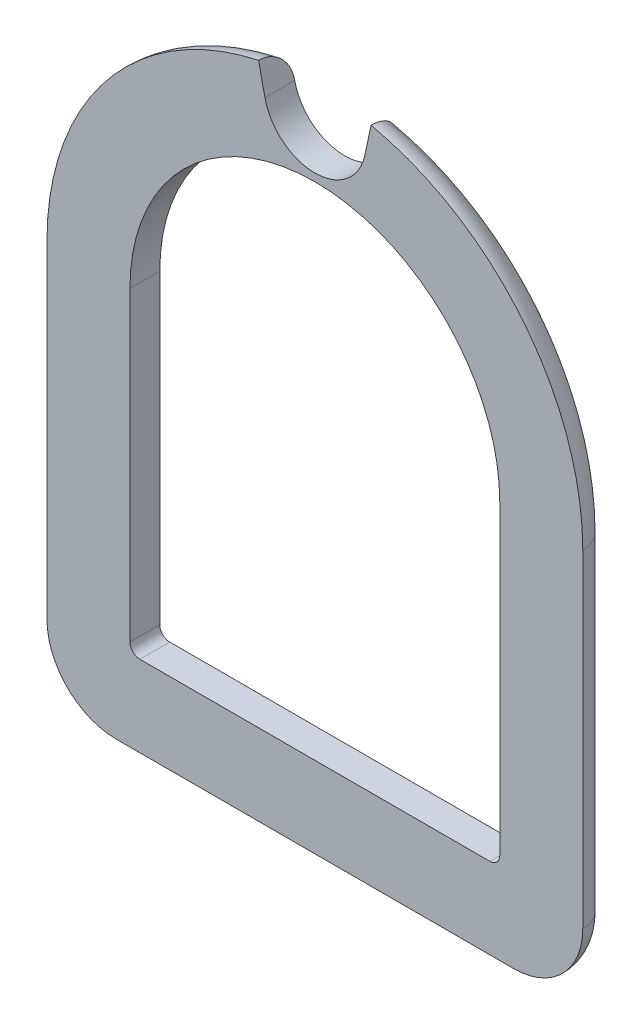
ISO-10303-21;
HEADER;
FILE_DESCRIPTION(('STEP AP214'),'2;1');
FILE_NAME('part.step','',(''),(''),'','','');
FILE_SCHEMA(('AUTOMOTIVE_DESIGN { 1 0 10303 214 1 1 1 1 }'));
ENDSEC;
DATA;
#1=APPLICATION_CONTEXT('core data for automotive mechanical design processes');
#2=APPLICATION_PROTOCOL_DEFINITION('international standard','automotive_design',2000,#1);
#3=PRODUCT_CONTEXT('',#1,'mechanical');
#4=PRODUCT('Part','Part','',(#3));
#5=PRODUCT_RELATED_PRODUCT_CATEGORY('part','',(#4));
#6=PRODUCT_DEFINITION_FORMATION('','',#4);
#7=PRODUCT_DEFINITION_CONTEXT('part definition',#1,'design');
#8=PRODUCT_DEFINITION('design','',#6,#7);
#9=PRODUCT_DEFINITION_SHAPE('','',#8);
#10=(LENGTH_UNIT() NAMED_UNIT(*) SI_UNIT(.MILLI.,.METRE.));
#11=(NAMED_UNIT(*) PLANE_ANGLE_UNIT() SI_UNIT($,.RADIAN.));
#12=(NAMED_UNIT(*) SI_UNIT($,.STERADIAN.) SOLID_ANGLE_UNIT());
#13=UNCERTAINTY_MEASURE_WITH_UNIT(LENGTH_MEASURE(1.E-05),#10,'distance_accuracy_value','');
#14=(GEOMETRIC_REPRESENTATION_CONTEXT(3) GLOBAL_UNCERTAINTY_ASSIGNED_CONTEXT((#13)) GLOBAL_UNIT_ASSIGNED_CONTEXT((#10,
#11,#12)) REPRESENTATION_CONTEXT('',''));
#15=CARTESIAN_POINT('',(0.,0.,0.));
#16=DIRECTION('',(0.,0.,1.));
#17=DIRECTION('',(1.,0.,0.));
#18=AXIS2_PLACEMENT_3D('',#15,#16,#17);
#19=CARTESIAN_POINT('',(0.,0.,56.8469714478884));
#20=DIRECTION('',(0.,0.,-1.));
#21=DIRECTION('',(-1.,0.,0.));
#22=AXIS2_PLACEMENT_3D('',#19,#20,#21);
#23=CYLINDRICAL_SURFACE('',#22,9.3);
#24=DIRECTION('',(0.,0.,-1.));
#25=VECTOR('',#24,1.);
#26=CARTESIAN_POINT('',(9.3,0.,56.8469714478884));
#27=LINE('',#26,#25);
#28=CARTESIAN_POINT('',(9.3,0.,1.5));
#29=VERTEX_POINT('',#28);
#30=CARTESIAN_POINT('',(9.3,0.,0.));
#31=VERTEX_POINT('',#30);
#32=EDGE_CURVE('E234',#29,#31,#27,.T.);
#33=ORIENTED_EDGE('',*,*,#32,.F.);
#34=CARTESIAN_POINT('',(0.,0.,1.5));
#35=DIRECTION('',(0.,0.,1.));
#36=DIRECTION('',(1.,0.,0.));
#37=AXIS2_PLACEMENT_3D('',#34,#35,#36);
#38=CIRCLE('',#37,9.3);
#39=CARTESIAN_POINT('',(-9.3,0.,1.5));
#40=VERTEX_POINT('',#39);
#41=EDGE_CURVE('E426',#29,#40,#38,.T.);
#42=ORIENTED_EDGE('',*,*,#41,.T.);
#43=DIRECTION('',(0.,0.,-1.));
#44=VECTOR('',#43,1.);
#45=CARTESIAN_POINT('',(-9.3,0.,56.8469714478884));
#46=LINE('',#45,#44);
#47=CARTESIAN_POINT('',(-9.3,0.,0.));
#48=VERTEX_POINT('',#47);
#49=EDGE_CURVE('E76',#40,#48,#46,.T.);
#50=ORIENTED_EDGE('',*,*,#49,.T.);
#51=CARTESIAN_POINT('',(0.,0.,0.));
#52=DIRECTION('',(0.,0.,1.));
#53=DIRECTION('',(1.,0.,0.));
#54=AXIS2_PLACEMENT_3D('',#51,#52,#53);
#55=CIRCLE('',#54,9.3);
#56=EDGE_CURVE('E60',#31,#48,#55,.T.);
#57=ORIENTED_EDGE('',*,*,#56,.F.);
#58=EDGE_LOOP('',(#33,#42,#50,#57));
#59=FACE_BOUND('',#58,.T.);
#60=ADVANCED_FACE('F48',(#59),#23,.F.);
#61=CARTESIAN_POINT('',(-9.3,-15.9,56.8469714478884));
#62=DIRECTION('',(1.,0.,0.));
#63=DIRECTION('',(0.,0.,-1.));
#64=AXIS2_PLACEMENT_3D('',#61,#62,#63);
#65=PLANE('',#64);
#66=ORIENTED_EDGE('',*,*,#49,.F.);
#67=DIRECTION('',(0.,-1.,0.));
#68=VECTOR('',#67,1.);
#69=CARTESIAN_POINT('',(-9.3,-15.9,1.5));
#70=LINE('',#69,#68);
#71=CARTESIAN_POINT('',(-9.3,-15.4,1.5));
#72=VERTEX_POINT('',#71);
#73=EDGE_CURVE('E432',#40,#72,#70,.T.);
#74=ORIENTED_EDGE('',*,*,#73,.T.);
#75=DIRECTION('',(0.,0.,-1.));
#76=VECTOR('',#75,1.);
#77=CARTESIAN_POINT('',(-9.3,-15.4,0.));
#78=LINE('',#77,#76);
#79=CARTESIAN_POINT('',(-9.3,-15.4,0.));
#80=VERTEX_POINT('',#79);
#81=EDGE_CURVE('E245',#72,#80,#78,.T.);
#82=ORIENTED_EDGE('',*,*,#81,.T.);
#83=DIRECTION('',(0.,-1.,0.));
#84=VECTOR('',#83,1.);
#85=CARTESIAN_POINT('',(-9.3,-15.9,0.));
#86=LINE('',#85,#84);
#87=EDGE_CURVE('E238',#48,#80,#86,.T.);
#88=ORIENTED_EDGE('',*,*,#87,.F.);
#89=EDGE_LOOP('',(#66,#74,#82,#88));
#90=FACE_BOUND('',#89,.T.);
#91=ADVANCED_FACE('F457',(#90),#65,.T.);
#92=CARTESIAN_POINT('',(0.,-15.9,56.8469714478884));
#93=DIRECTION('',(0.,1.,0.));
#94=DIRECTION('',(0.,0.,1.));
#95=AXIS2_PLACEMENT_3D('',#92,#93,#94);
#96=PLANE('',#95);
#97=DIRECTION('',(0.,0.,-1.));
#98=VECTOR('',#97,1.);
#99=CARTESIAN_POINT('',(-8.8,-15.9,6.02159565602451));
#100=LINE('',#99,#98);
#101=CARTESIAN_POINT('',(-8.8,-15.9,0.));
#102=VERTEX_POINT('',#101);
#103=CARTESIAN_POINT('',(-8.8,-15.9,1.5));
#104=VERTEX_POINT('',#103);
#105=EDGE_CURVE('E256',#102,#104,#100,.F.);
#106=ORIENTED_EDGE('',*,*,#105,.T.);
#107=DIRECTION('',(1.,0.,0.));
#108=VECTOR('',#107,1.);
#109=CARTESIAN_POINT('',(0.,-15.9,1.5));
#110=LINE('',#109,#108);
#111=CARTESIAN_POINT('',(8.8,-15.9,1.5));
#112=VERTEX_POINT('',#111);
#113=EDGE_CURVE('E422',#104,#112,#110,.T.);
#114=ORIENTED_EDGE('',*,*,#113,.T.);
#115=DIRECTION('',(0.,0.,-1.));
#116=VECTOR('',#115,1.);
#117=CARTESIAN_POINT('',(8.8,-15.9,0.));
#118=LINE('',#117,#116);
#119=CARTESIAN_POINT('',(8.8,-15.9,0.));
#120=VERTEX_POINT('',#119);
#121=EDGE_CURVE('E253',#112,#120,#118,.T.);
#122=ORIENTED_EDGE('',*,*,#121,.T.);
#123=DIRECTION('',(1.,0.,0.));
#124=VECTOR('',#123,1.);
#125=CARTESIAN_POINT('',(0.,-15.9,0.));
#126=LINE('',#125,#124);
#127=EDGE_CURVE('E233',#102,#120,#126,.T.);
#128=ORIENTED_EDGE('',*,*,#127,.F.);
#129=EDGE_LOOP('',(#106,#114,#122,#128));
#130=FACE_BOUND('',#129,.T.);
#131=ADVANCED_FACE('F451',(#130),#96,.T.);
#132=CARTESIAN_POINT('',(-8.8,-15.4,56.8469714478884));
#133=DIRECTION('',(0.,0.,1.));
#134=DIRECTION('',(1.,0.,0.));
#135=AXIS2_PLACEMENT_3D('',#132,#133,#134);
#136=CYLINDRICAL_SURFACE('',#135,0.5);
#137=CARTESIAN_POINT('',(-8.8,-15.4,1.5));
#138=DIRECTION('',(0.,0.,1.));
#139=DIRECTION('',(1.,0.,0.));
#140=AXIS2_PLACEMENT_3D('',#137,#138,#139);
#141=CIRCLE('',#140,0.5);
#142=EDGE_CURVE('E429',#104,#72,#141,.F.);
#143=ORIENTED_EDGE('',*,*,#142,.F.);
#144=ORIENTED_EDGE('',*,*,#105,.F.);
#145=CARTESIAN_POINT('',(-8.8,-15.4,0.));
#146=DIRECTION('',(0.,0.,1.));
#147=DIRECTION('',(1.,0.,0.));
#148=AXIS2_PLACEMENT_3D('',#145,#146,#147);
#149=CIRCLE('',#148,0.5);
#150=EDGE_CURVE('E435',#80,#102,#149,.T.);
#151=ORIENTED_EDGE('',*,*,#150,.F.);
#152=ORIENTED_EDGE('',*,*,#81,.F.);
#153=EDGE_LOOP('',(#143,#144,#151,#152));
#154=FACE_BOUND('',#153,.T.);
#155=ADVANCED_FACE('F454',(#154),#136,.F.);
#156=CARTESIAN_POINT('',(9.3,0.,56.8469714478884));
#157=DIRECTION('',(-1.,0.,0.));
#158=DIRECTION('',(0.,-1.,0.));
#159=AXIS2_PLACEMENT_3D('',#156,#157,#158);
#160=PLANE('',#159);
#161=DIRECTION('',(0.,0.,-1.));
#162=VECTOR('',#161,1.);
#163=CARTESIAN_POINT('',(9.3,-15.4,6.0215956560245));
#164=LINE('',#163,#162);
#165=CARTESIAN_POINT('',(9.3,-15.4,0.));
#166=VERTEX_POINT('',#165);
#167=CARTESIAN_POINT('',(9.3,-15.4,1.5));
#168=VERTEX_POINT('',#167);
#169=EDGE_CURVE('E248',#166,#168,#164,.F.);
#170=ORIENTED_EDGE('',*,*,#169,.T.);
#171=DIRECTION('',(0.,1.,0.));
#172=VECTOR('',#171,1.);
#173=CARTESIAN_POINT('',(9.3,0.,1.5));
#174=LINE('',#173,#172);
#175=EDGE_CURVE('E68',#168,#29,#174,.T.);
#176=ORIENTED_EDGE('',*,*,#175,.T.);
#177=ORIENTED_EDGE('',*,*,#32,.T.);
#178=DIRECTION('',(0.,1.,0.));
#179=VECTOR('',#178,1.);
#180=CARTESIAN_POINT('',(9.3,0.,0.));
#181=LINE('',#180,#179);
#182=EDGE_CURVE('E229',#166,#31,#181,.T.);
#183=ORIENTED_EDGE('',*,*,#182,.F.);
#184=EDGE_LOOP('',(#170,#176,#177,#183));
#185=FACE_BOUND('',#184,.T.);
#186=ADVANCED_FACE('F447',(#185),#160,.T.);
#187=CARTESIAN_POINT('',(8.8,-15.4,56.8469714478884));
#188=DIRECTION('',(0.,0.,1.));
#189=DIRECTION('',(1.,0.,0.));
#190=AXIS2_PLACEMENT_3D('',#187,#188,#189);
#191=CYLINDRICAL_SURFACE('',#190,0.5);
#192=CARTESIAN_POINT('',(8.8,-15.4,1.5));
#193=DIRECTION('',(0.,0.,1.));
#194=DIRECTION('',(1.,0.,0.));
#195=AXIS2_PLACEMENT_3D('',#192,#193,#194);
#196=CIRCLE('',#195,0.5);
#197=EDGE_CURVE('E412',#168,#112,#196,.F.);
#198=ORIENTED_EDGE('',*,*,#197,.F.);
#199=ORIENTED_EDGE('',*,*,#169,.F.);
#200=CARTESIAN_POINT('',(8.8,-15.4,0.));
#201=DIRECTION('',(0.,0.,1.));
#202=DIRECTION('',(1.,0.,0.));
#203=AXIS2_PLACEMENT_3D('',#200,#201,#202);
#204=CIRCLE('',#203,0.5);
#205=EDGE_CURVE('E249',#120,#166,#204,.T.);
#206=ORIENTED_EDGE('',*,*,#205,.F.);
#207=ORIENTED_EDGE('',*,*,#121,.F.);
#208=EDGE_LOOP('',(#198,#199,#206,#207));
#209=FACE_BOUND('',#208,.T.);
#210=ADVANCED_FACE('F50',(#209),#191,.F.);
#211=CARTESIAN_POINT('',(0.,-3.47193681858,1.5));
#212=DIRECTION('',(0.,0.,1.));
#213=DIRECTION('',(1.,0.,0.));
#214=AXIS2_PLACEMENT_3D('',#211,#212,#213);
#215=PLANE('',#214);
#216=DIRECTION('',(0.211070278329672,0.977470888367441,0.));
#217=VECTOR('',#216,1.);
#218=CARTESIAN_POINT('',(-0.731673316073909,-3.31394286468532,1.5));
#219=LINE('',#218,#217);
#220=CARTESIAN_POINT('',(2.51190607819,11.7071413784,1.5));
#221=VERTEX_POINT('',#220);
#222=CARTESIAN_POINT('',(2.82851173798511,13.1733488330503,1.5));
#223=VERTEX_POINT('',#222);
#224=EDGE_CURVE('E368',#221,#223,#219,.T.);
#225=ORIENTED_EDGE('',*,*,#224,.F.);
#226=CARTESIAN_POINT('',(0.,12.2495500796423,1.5));
#227=DIRECTION('',(0.,0.,1.));
#228=DIRECTION('',(1.,0.,0.));
#229=AXIS2_PLACEMENT_3D('',#226,#227,#228);
#230=CIRCLE('',#229,2.56980142128361);
#231=CARTESIAN_POINT('',(-2.51190607819,11.7071413784,1.5));
#232=VERTEX_POINT('',#231);
#233=EDGE_CURVE('E363',#232,#221,#230,.T.);
#234=ORIENTED_EDGE('',*,*,#233,.F.);
#235=DIRECTION('',(0.211070278329672,-0.977470888367441,0.));
#236=VECTOR('',#235,1.);
#237=CARTESIAN_POINT('',(0.731673316073911,-3.31394286468532,1.5));
#238=LINE('',#237,#236);
#239=CARTESIAN_POINT('',(-2.82851173798511,13.1733488330503,1.5));
#240=VERTEX_POINT('',#239);
#241=EDGE_CURVE('E203',#240,#232,#238,.T.);
#242=ORIENTED_EDGE('',*,*,#241,.F.);
#243=CARTESIAN_POINT('',(0.,0.,1.5));
#244=DIRECTION('',(0.,0.,-1.));
#245=DIRECTION('',(1.,0.,0.));
#246=AXIS2_PLACEMENT_3D('',#243,#244,#245);
#247=CIRCLE('',#246,13.4735889105);
#248=CARTESIAN_POINT('',(-13.4735889105,0.,1.5));
#249=VERTEX_POINT('',#248);
#250=EDGE_CURVE('E195',#249,#240,#247,.T.);
#251=ORIENTED_EDGE('',*,*,#250,.F.);
#252=DIRECTION('',(0.,1.,0.));
#253=VECTOR('',#252,1.);
#254=CARTESIAN_POINT('',(-13.4735889105,0.,1.5));
#255=LINE('',#254,#253);
#256=CARTESIAN_POINT('',(-13.47358891,-16.5,1.5));
#257=VERTEX_POINT('',#256);
#258=EDGE_CURVE('E346',#257,#249,#255,.T.);
#259=ORIENTED_EDGE('',*,*,#258,.F.);
#260=CARTESIAN_POINT('',(-10.,-16.5,1.5));
#261=DIRECTION('',(0.,0.,-1.));
#262=DIRECTION('',(1.,0.,0.));
#263=AXIS2_PLACEMENT_3D('',#260,#261,#262);
#264=CIRCLE('',#263,3.47358891054);
#265=CARTESIAN_POINT('',(-10.,-19.9735889105,1.5));
#266=VERTEX_POINT('',#265);
#267=EDGE_CURVE('E304',#266,#257,#264,.T.);
#268=ORIENTED_EDGE('',*,*,#267,.F.);
#269=DIRECTION('',(-1.,0.,0.));
#270=VECTOR('',#269,1.);
#271=CARTESIAN_POINT('',(-10.,-19.9735889105,1.5));
#272=LINE('',#271,#270);
#273=CARTESIAN_POINT('',(10.,-19.97358891,1.5));
#274=VERTEX_POINT('',#273);
#275=EDGE_CURVE('E316',#274,#266,#272,.T.);
#276=ORIENTED_EDGE('',*,*,#275,.F.);
#277=CARTESIAN_POINT('',(10.,-16.5,1.5));
#278=DIRECTION('',(0.,0.,-1.));
#279=DIRECTION('',(1.,0.,0.));
#280=AXIS2_PLACEMENT_3D('',#277,#278,#279);
#281=CIRCLE('',#280,3.47358891054);
#282=CARTESIAN_POINT('',(13.4735889105,-16.5,1.5));
#283=VERTEX_POINT('',#282);
#284=EDGE_CURVE('E313',#283,#274,#281,.T.);
#285=ORIENTED_EDGE('',*,*,#284,.F.);
#286=DIRECTION('',(0.,-1.,0.));
#287=VECTOR('',#286,1.);
#288=CARTESIAN_POINT('',(13.4735889105,-16.5,1.5));
#289=LINE('',#288,#287);
#290=CARTESIAN_POINT('',(13.47358891,0.,1.5));
#291=VERTEX_POINT('',#290);
#292=EDGE_CURVE('E317',#291,#283,#289,.T.);
#293=ORIENTED_EDGE('',*,*,#292,.F.);
#294=CARTESIAN_POINT('',(0.,0.,1.5));
#295=DIRECTION('',(0.,0.,-1.));
#296=DIRECTION('',(1.,0.,0.));
#297=AXIS2_PLACEMENT_3D('',#294,#295,#296);
#298=CIRCLE('',#297,13.4735889105);
#299=EDGE_CURVE('E268',#223,#291,#298,.T.);
#300=ORIENTED_EDGE('',*,*,#299,.F.);
#301=EDGE_LOOP('',(#225,#234,#242,#251,#259,#268,#276,#285,#293,#300));
#302=FACE_BOUND('',#301,.T.);
#303=ORIENTED_EDGE('',*,*,#41,.F.);
#304=ORIENTED_EDGE('',*,*,#175,.F.);
#305=ORIENTED_EDGE('',*,*,#197,.T.);
#306=ORIENTED_EDGE('',*,*,#113,.F.);
#307=ORIENTED_EDGE('',*,*,#142,.T.);
#308=ORIENTED_EDGE('',*,*,#73,.F.);
#309=EDGE_LOOP('',(#303,#304,#305,#306,#307,#308));
#310=FACE_BOUND('',#309,.T.);
#311=ADVANCED_FACE('F362',(#302,#310),#215,.T.);
#312=CARTESIAN_POINT('',(0.,0.,1.5));
#313=DIRECTION('',(0.,0.,1.));
#314=DIRECTION('',(1.,0.,0.));
#315=AXIS2_PLACEMENT_3D('',#312,#313,#314);
#316=TOROIDAL_SURFACE('',#315,11.9735889105,1.5);
#317=CARTESIAN_POINT('',(-2.51186289116912,11.7069413784,1.3955005129252E-08));
#318=CARTESIAN_POINT('',(-2.52077053922017,11.7481928834562,-5.46214041297056E-06));
#319=CARTESIAN_POINT('',(-2.52967397112958,11.789424863472,0.00177065051819319));
#320=CARTESIAN_POINT('',(-2.54741722546145,11.8715942466345,0.00886777480013707));
#321=CARTESIAN_POINT('',(-2.556257050915,11.9125316638184,0.0141886163574209));
#322=CARTESIAN_POINT('',(-2.58257060020554,12.0343902627868,0.0354176435810422));
#323=CARTESIAN_POINT('',(-2.59986822122613,12.1144959087329,0.056592453322303));
#324=CARTESIAN_POINT('',(-2.63346710240488,12.2700930325623,0.112399317916053));
#325=CARTESIAN_POINT('',(-2.64976788056635,12.3455822783086,0.147037824158912));
#326=CARTESIAN_POINT('',(-2.68091026112063,12.489803296195,0.228785451184035));
#327=CARTESIAN_POINT('',(-2.69575211114448,12.5585362151196,0.27589245059801));
#328=CARTESIAN_POINT('',(-2.72355535633424,12.6872936270593,0.381240856420789));
#329=CARTESIAN_POINT('',(-2.7365167574232,12.7473181475043,0.439482227757039));
#330=CARTESIAN_POINT('',(-2.76019427582089,12.8569692320893,0.565460301869223));
#331=CARTESIAN_POINT('',(-2.77090999877309,12.9065939699562,0.633198668902965));
#332=CARTESIAN_POINT('',(-2.78979015131299,12.9940283525785,0.776242649067455));
#333=CARTESIAN_POINT('',(-2.79795415020764,13.0318360027856,0.851549536820192));
#334=CARTESIAN_POINT('',(-2.81149407963012,13.0945397000837,1.0075761791148));
#335=CARTESIAN_POINT('',(-2.81687144163638,13.1194423763815,1.08829313042508));
#336=CARTESIAN_POINT('',(-2.82346702314377,13.1499866527541,1.22706313681973));
#337=CARTESIAN_POINT('',(-2.82545980161746,13.1592152516853,1.28431753801307));
#338=CARTESIAN_POINT('',(-2.82803607831788,13.1711460431494,1.3994578748974));
#339=CARTESIAN_POINT('',(-2.82862141091825,13.1738567307052,1.45734288967731));
#340=CARTESIAN_POINT('',(-2.82849544160232,13.1732733641597,1.5152190294818));
#341=B_SPLINE_CURVE_WITH_KNOTS('',3,(#317,#318,#319,#320,#321,#322,#323,#324,#325,#326,#327,
#328,#329,#330,#331,#332,#333,#334,#335,#336,#337,#338,#339,#340),.UNSPECIFIED.,.F.,.F.,(4,2,2,
2,2,2,2,2,2,2,2,4),(0.,0.126529090867996,0.253052111665677,0.505679648369438,0.758428385965787,
1.01113414893132,1.26383911590307,1.51658842248792,1.7693803663861,2.02204232355108,
2.19576009137469,2.36925132371266),.UNSPECIFIED.);
#342=CARTESIAN_POINT('',(-2.51190607819,11.7071413784,0.));
#343=VERTEX_POINT('',#342);
#344=EDGE_CURVE('E201',#343,#240,#341,.T.);
#345=ORIENTED_EDGE('',*,*,#344,.F.);
#346=CARTESIAN_POINT('',(0.,0.,0.));
#347=DIRECTION('',(0.,0.,-1.));
#348=DIRECTION('',(1.,0.,0.));
#349=AXIS2_PLACEMENT_3D('',#346,#347,#348);
#350=CIRCLE('',#349,11.9735889105);
#351=CARTESIAN_POINT('',(-11.97358891,0.,0.));
#352=VERTEX_POINT('',#351);
#353=EDGE_CURVE('E194',#352,#343,#350,.T.);
#354=ORIENTED_EDGE('',*,*,#353,.F.);
#355=CARTESIAN_POINT('',(-11.9735889105,0.,1.5));
#356=DIRECTION('',(0.,-1.,0.));
#357=DIRECTION('',(1.,0.,0.));
#358=AXIS2_PLACEMENT_3D('',#355,#356,#357);
#359=CIRCLE('',#358,1.5);
#360=EDGE_CURVE('E278',#249,#352,#359,.T.);
#361=ORIENTED_EDGE('',*,*,#360,.F.);
#362=ORIENTED_EDGE('',*,*,#250,.T.);
#363=EDGE_LOOP('',(#345,#354,#361,#362));
#364=FACE_BOUND('',#363,.T.);
#365=ADVANCED_FACE('F208',(#364),#316,.T.);
#366=CARTESIAN_POINT('',(-11.9735889105,0.,1.5));
#367=DIRECTION('',(0.,1.,0.));
#368=DIRECTION('',(1.,0.,0.));
#369=AXIS2_PLACEMENT_3D('',#366,#367,#368);
#370=CYLINDRICAL_SURFACE('',#369,1.5);
#371=CARTESIAN_POINT('',(-11.9735889105,-16.5,1.5));
#372=DIRECTION('',(0.,1.,0.));
#373=DIRECTION('',(1.,0.,0.));
#374=AXIS2_PLACEMENT_3D('',#371,#372,#373);
#375=CIRCLE('',#374,1.5);
#376=CARTESIAN_POINT('',(-11.9735889105,-16.5,0.));
#377=VERTEX_POINT('',#376);
#378=EDGE_CURVE('E281',#377,#257,#375,.T.);
#379=ORIENTED_EDGE('',*,*,#378,.T.);
#380=ORIENTED_EDGE('',*,*,#258,.T.);
#381=ORIENTED_EDGE('',*,*,#360,.T.);
#382=DIRECTION('',(0.,1.,0.));
#383=VECTOR('',#382,1.);
#384=CARTESIAN_POINT('',(-11.9735889105,0.,0.));
#385=LINE('',#384,#383);
#386=EDGE_CURVE('E215',#377,#352,#385,.T.);
#387=ORIENTED_EDGE('',*,*,#386,.F.);
#388=EDGE_LOOP('',(#379,#380,#381,#387));
#389=FACE_BOUND('',#388,.T.);
#390=ADVANCED_FACE('F355',(#389),#370,.T.);
#391=CARTESIAN_POINT('',(-10.,-16.5,1.5));
#392=DIRECTION('',(0.,0.,1.));
#393=DIRECTION('',(-1.,0.,0.));
#394=AXIS2_PLACEMENT_3D('',#391,#392,#393);
#395=TOROIDAL_SURFACE('',#394,1.97358891054,1.5);
#396=CARTESIAN_POINT('',(-10.,-18.4735889105,1.5));
#397=DIRECTION('',(-1.,0.,0.));
#398=DIRECTION('',(0.,-1.,0.));
#399=AXIS2_PLACEMENT_3D('',#396,#397,#398);
#400=CIRCLE('',#399,1.5);
#401=CARTESIAN_POINT('',(-10.,-18.47358891,0.));
#402=VERTEX_POINT('',#401);
#403=EDGE_CURVE('E308',#402,#266,#400,.T.);
#404=ORIENTED_EDGE('',*,*,#403,.T.);
#405=ORIENTED_EDGE('',*,*,#267,.T.);
#406=ORIENTED_EDGE('',*,*,#378,.F.);
#407=CARTESIAN_POINT('',(-10.,-16.5,0.));
#408=DIRECTION('',(0.,0.,-1.));
#409=DIRECTION('',(1.,0.,0.));
#410=AXIS2_PLACEMENT_3D('',#407,#408,#409);
#411=CIRCLE('',#410,1.97358891054);
#412=EDGE_CURVE('E221',#402,#377,#411,.T.);
#413=ORIENTED_EDGE('',*,*,#412,.F.);
#414=EDGE_LOOP('',(#404,#405,#406,#413));
#415=FACE_BOUND('',#414,.T.);
#416=ADVANCED_FACE('F359',(#415),#395,.T.);
#417=CARTESIAN_POINT('',(-10.,-18.4735889105,1.5));
#418=DIRECTION('',(-1.,0.,0.));
#419=DIRECTION('',(0.,1.,0.));
#420=AXIS2_PLACEMENT_3D('',#417,#418,#419);
#421=CYLINDRICAL_SURFACE('',#420,1.5);
#422=CARTESIAN_POINT('',(10.,-18.4735889105,1.5));
#423=DIRECTION('',(-1.,0.,0.));
#424=DIRECTION('',(0.,-1.,0.));
#425=AXIS2_PLACEMENT_3D('',#422,#423,#424);
#426=CIRCLE('',#425,1.5);
#427=CARTESIAN_POINT('',(10.,-18.4735889105,0.));
#428=VERTEX_POINT('',#427);
#429=EDGE_CURVE('E309',#428,#274,#426,.T.);
#430=ORIENTED_EDGE('',*,*,#429,.T.);
#431=ORIENTED_EDGE('',*,*,#275,.T.);
#432=ORIENTED_EDGE('',*,*,#403,.F.);
#433=DIRECTION('',(-1.,0.,0.));
#434=VECTOR('',#433,1.);
#435=CARTESIAN_POINT('',(-10.,-18.4735889105,0.));
#436=LINE('',#435,#434);
#437=EDGE_CURVE('E299',#428,#402,#436,.T.);
#438=ORIENTED_EDGE('',*,*,#437,.F.);
#439=EDGE_LOOP('',(#430,#431,#432,#438));
#440=FACE_BOUND('',#439,.T.);
#441=ADVANCED_FACE('F482',(#440),#421,.T.);
#442=CARTESIAN_POINT('',(10.,-16.5,1.5));
#443=DIRECTION('',(0.,0.,1.));
#444=DIRECTION('',(-1.,0.,0.));
#445=AXIS2_PLACEMENT_3D('',#442,#443,#444);
#446=TOROIDAL_SURFACE('',#445,1.97358891054,1.5);
#447=CARTESIAN_POINT('',(11.9735889105,-16.5,1.5));
#448=DIRECTION('',(0.,1.,0.));
#449=DIRECTION('',(1.,0.,0.));
#450=AXIS2_PLACEMENT_3D('',#447,#448,#449);
#451=CIRCLE('',#450,1.5);
#452=CARTESIAN_POINT('',(11.97358891,-16.5,0.));
#453=VERTEX_POINT('',#452);
#454=EDGE_CURVE('E272',#283,#453,#451,.T.);
#455=ORIENTED_EDGE('',*,*,#454,.F.);
#456=ORIENTED_EDGE('',*,*,#284,.T.);
#457=ORIENTED_EDGE('',*,*,#429,.F.);
#458=CARTESIAN_POINT('',(10.,-16.5,0.));
#459=DIRECTION('',(0.,0.,-1.));
#460=DIRECTION('',(1.,0.,0.));
#461=AXIS2_PLACEMENT_3D('',#458,#459,#460);
#462=CIRCLE('',#461,1.97358891054);
#463=EDGE_CURVE('E293',#453,#428,#462,.T.);
#464=ORIENTED_EDGE('',*,*,#463,.F.);
#465=EDGE_LOOP('',(#455,#456,#457,#464));
#466=FACE_BOUND('',#465,.T.);
#467=ADVANCED_FACE('F403',(#466),#446,.T.);
#468=CARTESIAN_POINT('',(11.9735889105,-16.5,1.5));
#469=DIRECTION('',(0.,1.,0.));
#470=DIRECTION('',(1.,0.,0.));
#471=AXIS2_PLACEMENT_3D('',#468,#469,#470);
#472=CYLINDRICAL_SURFACE('',#471,1.5);
#473=CARTESIAN_POINT('',(11.9735889105,0.,1.5));
#474=DIRECTION('',(0.,1.,0.));
#475=DIRECTION('',(1.,0.,0.));
#476=AXIS2_PLACEMENT_3D('',#473,#474,#475);
#477=CIRCLE('',#476,1.5);
#478=CARTESIAN_POINT('',(11.9735889105,0.,0.));
#479=VERTEX_POINT('',#478);
#480=EDGE_CURVE('E260',#291,#479,#477,.T.);
#481=ORIENTED_EDGE('',*,*,#480,.F.);
#482=ORIENTED_EDGE('',*,*,#292,.T.);
#483=ORIENTED_EDGE('',*,*,#454,.T.);
#484=DIRECTION('',(0.,-1.,0.));
#485=VECTOR('',#484,1.);
#486=CARTESIAN_POINT('',(11.9735889105,-16.5,0.));
#487=LINE('',#486,#485);
#488=EDGE_CURVE('E286',#479,#453,#487,.T.);
#489=ORIENTED_EDGE('',*,*,#488,.F.);
#490=EDGE_LOOP('',(#481,#482,#483,#489));
#491=FACE_BOUND('',#490,.T.);
#492=ADVANCED_FACE('F483',(#491),#472,.T.);
#493=CARTESIAN_POINT('',(0.,0.,1.5));
#494=DIRECTION('',(0.,0.,1.));
#495=DIRECTION('',(1.,0.,0.));
#496=AXIS2_PLACEMENT_3D('',#493,#494,#495);
#497=TOROIDAL_SURFACE('',#496,11.9735889105,1.5);
#498=CARTESIAN_POINT('',(2.82849728010464,13.1732818783025,1.51433488770651));
#499=CARTESIAN_POINT('',(2.82858234753868,13.1736758273747,1.47213461178377));
#500=CARTESIAN_POINT('',(2.82829135210719,13.1723282214248,1.42993752713651));
#501=CARTESIAN_POINT('',(2.82696057370414,13.1661653587131,1.34581131697817));
#502=CARTESIAN_POINT('',(2.82592082665772,13.1613502683216,1.30388217870837));
#503=CARTESIAN_POINT('',(2.82168809422304,13.1417483955904,1.17902072171804));
#504=CARTESIAN_POINT('',(2.81738187280572,13.1218061938384,1.09687308528849));
#505=CARTESIAN_POINT('',(2.80591975081221,13.0687248663477,0.937171341852976));
#506=CARTESIAN_POINT('',(2.79876248400632,13.0355794135706,0.859619457643089));
#507=CARTESIAN_POINT('',(2.7818021543918,12.9570357712041,0.711311138515617));
#508=CARTESIAN_POINT('',(2.77199954252687,12.9116396699446,0.640553548180704));
#509=CARTESIAN_POINT('',(2.75002657207463,12.8098823826657,0.507842169365131));
#510=CARTESIAN_POINT('',(2.7378562201874,12.7535212276746,0.445888355972909));
#511=CARTESIAN_POINT('',(2.71149026151888,12.6314199197769,0.33252831182898));
#512=CARTESIAN_POINT('',(2.69729429745607,12.5656781122921,0.281123945718095));
#513=CARTESIAN_POINT('',(2.66728115332388,12.4266866119741,0.190330644797051));
#514=CARTESIAN_POINT('',(2.65146369554882,12.35343563308,0.150943772775659));
#515=CARTESIAN_POINT('',(2.61866010145807,12.2015215004447,0.0853278059641333));
#516=CARTESIAN_POINT('',(2.6016745750957,12.1228611714102,0.0590919023209431));
#517=CARTESIAN_POINT('',(2.57247802749635,11.9876513467725,0.0265712525503941));
#518=CARTESIAN_POINT('',(2.56044363198519,11.9319198086121,0.0166079416289134));
#519=CARTESIAN_POINT('',(2.53622872732611,11.8197800769732,0.00331802157496418));
#520=CARTESIAN_POINT('',(2.52404843044437,11.7633728665037,-1.72721694362899E-05));
#521=CARTESIAN_POINT('',(2.51186289116912,11.7069413784,1.39550051228213E-08));
#522=B_SPLINE_CURVE_WITH_KNOTS('',3,(#498,#499,#500,#501,#502,#503,#504,#505,#506,#507,#508,
#509,#510,#511,#512,#513,#514,#515,#516,#517,#518,#519,#520,#521),.UNSPECIFIED.,.F.,.F.,(4,2,2,
2,2,2,2,2,2,2,2,4),(0.,0.126528835996847,0.253051601536933,0.505678685361915,0.758426974774129,
1.01113220616182,1.26383672246919,1.51658586652656,1.76937837030302,2.02203985639242,
2.19531783543092,2.36836862030141),.UNSPECIFIED.);
#523=CARTESIAN_POINT('',(2.51190607819,11.7071413784,0.));
#524=VERTEX_POINT('',#523);
#525=EDGE_CURVE('E365',#223,#524,#522,.T.);
#526=ORIENTED_EDGE('',*,*,#525,.F.);
#527=ORIENTED_EDGE('',*,*,#299,.T.);
#528=ORIENTED_EDGE('',*,*,#480,.T.);
#529=CARTESIAN_POINT('',(0.,0.,0.));
#530=DIRECTION('',(0.,0.,-1.));
#531=DIRECTION('',(1.,0.,0.));
#532=AXIS2_PLACEMENT_3D('',#529,#530,#531);
#533=CIRCLE('',#532,11.9735889105);
#534=EDGE_CURVE('E283',#524,#479,#533,.T.);
#535=ORIENTED_EDGE('',*,*,#534,.F.);
#536=EDGE_LOOP('',(#526,#527,#528,#535));
#537=FACE_BOUND('',#536,.T.);
#538=ADVANCED_FACE('F389',(#537),#497,.T.);
#539=CARTESIAN_POINT('',(-0.0605118175783,-3.43744833568,0.));
#540=DIRECTION('',(0.,0.,1.));
#541=DIRECTION('',(1.,0.,0.));
#542=AXIS2_PLACEMENT_3D('',#539,#540,#541);
#543=PLANE('',#542);
#544=ORIENTED_EDGE('',*,*,#182,.T.);
#545=ORIENTED_EDGE('',*,*,#56,.T.);
#546=ORIENTED_EDGE('',*,*,#87,.T.);
#547=ORIENTED_EDGE('',*,*,#150,.T.);
#548=ORIENTED_EDGE('',*,*,#127,.T.);
#549=ORIENTED_EDGE('',*,*,#205,.T.);
#550=EDGE_LOOP('',(#544,#545,#546,#547,#548,#549));
#551=FACE_BOUND('',#550,.T.);
#552=ORIENTED_EDGE('',*,*,#353,.T.);
#553=CARTESIAN_POINT('',(-2.51190607819,11.7071413784,0.));
#554=CARTESIAN_POINT('',(-2.46095442595302,11.4711832076429,0.));
#555=CARTESIAN_POINT('',(-2.36673747934035,11.2483342943508,0.));
#556=CARTESIAN_POINT('',(-2.27284097393487,11.0262433123796,0.));
#557=CARTESIAN_POINT('',(-2.13857463152519,10.8246367874634,0.));
#558=CARTESIAN_POINT('',(-2.00491802537115,10.6239458070195,0.));
#559=CARTESIAN_POINT('',(-1.83541850838927,10.4509066341831,0.));
#560=CARTESIAN_POINT('',(-1.66649437088385,10.2784548564641,0.));
#561=CARTESIAN_POINT('',(-1.46789986851,10.1402494086,0.));
#562=B_SPLINE_CURVE_WITH_KNOTS('',2,(#553,#554,#555,#556,#557,#558,#559,#560,#561),
.UNSPECIFIED.,.F.,.F.,(3,2,2,2,3),(0.,0.25,0.5,0.75,1.),.UNSPECIFIED.);
#563=CARTESIAN_POINT('',(-1.46800588419733,10.1403231907578,0.));
#564=VERTEX_POINT('',#563);
#565=EDGE_CURVE('E185',#343,#564,#562,.T.);
#566=ORIENTED_EDGE('',*,*,#565,.T.);
#567=CARTESIAN_POINT('',(0.,12.2495500796423,0.));
#568=DIRECTION('',(0.,0.,1.));
#569=DIRECTION('',(1.,0.,0.));
#570=AXIS2_PLACEMENT_3D('',#567,#568,#569);
#571=CIRCLE('',#570,2.56980142128361);
#572=CARTESIAN_POINT('',(1.46874558088417,10.1409488301894,0.));
#573=VERTEX_POINT('',#572);
#574=EDGE_CURVE('E11',#564,#573,#571,.T.);
#575=ORIENTED_EDGE('',*,*,#574,.T.);
#576=CARTESIAN_POINT('',(1.46874342230232,10.1408367031317,0.));
#577=CARTESIAN_POINT('',(1.66672096143236,10.2787303645462,0.));
#578=CARTESIAN_POINT('',(1.83595798609394,10.4514573072501,0.));
#579=CARTESIAN_POINT('',(2.00461910833729,10.6235964715751,0.));
#580=CARTESIAN_POINT('',(2.13885955267143,10.8250645027489,0.));
#581=CARTESIAN_POINT('',(2.27249005196659,11.0256171285339,0.));
#582=CARTESIAN_POINT('',(2.36683758096849,11.2485709539127,0.));
#583=CARTESIAN_POINT('',(2.46086466741685,11.4707675374868,0.));
#584=CARTESIAN_POINT('',(2.51190607652893,11.7071413707075,0.));
#585=B_SPLINE_CURVE_WITH_KNOTS('',2,(#576,#577,#578,#579,#580,#581,#582,#583,#584),
.UNSPECIFIED.,.F.,.F.,(3,2,2,2,3),(0.,0.25,0.5,0.75,1.),.UNSPECIFIED.);
#586=EDGE_CURVE('E263',#573,#524,#585,.T.);
#587=ORIENTED_EDGE('',*,*,#586,.T.);
#588=ORIENTED_EDGE('',*,*,#534,.T.);
#589=ORIENTED_EDGE('',*,*,#488,.T.);
#590=ORIENTED_EDGE('',*,*,#463,.T.);
#591=ORIENTED_EDGE('',*,*,#437,.T.);
#592=ORIENTED_EDGE('',*,*,#412,.T.);
#593=ORIENTED_EDGE('',*,*,#386,.T.);
#594=EDGE_LOOP('',(#552,#566,#575,#587,#588,#589,#590,#591,#592,#593));
#595=FACE_BOUND('',#594,.T.);
#596=ADVANCED_FACE('F213',(#551,#595),#543,.F.);
#597=CARTESIAN_POINT('',(0.,12.2495500796423,10.));
#598=DIRECTION('',(0.,0.,-1.));
#599=DIRECTION('',(-1.,0.,0.));
#600=AXIS2_PLACEMENT_3D('',#597,#598,#599);
#601=CYLINDRICAL_SURFACE('',#600,2.56980142128361);
#602=ORIENTED_EDGE('',*,*,#233,.T.);
#603=DIRECTION('',(0.,0.,-1.));
#604=VECTOR('',#603,1.);
#605=CARTESIAN_POINT('',(2.51190607819,11.7071413784,10.));
#606=LINE('',#605,#604);
#607=EDGE_CURVE('E205',#221,#524,#606,.T.);
#608=ORIENTED_EDGE('',*,*,#607,.T.);
#609=ORIENTED_EDGE('',*,*,#586,.F.);
#610=ORIENTED_EDGE('',*,*,#574,.F.);
#611=ORIENTED_EDGE('',*,*,#565,.F.);
#612=DIRECTION('',(0.,0.,-1.));
#613=VECTOR('',#612,1.);
#614=CARTESIAN_POINT('',(-2.51190607819,11.7071413784,10.));
#615=LINE('',#614,#613);
#616=EDGE_CURVE('E189',#232,#343,#615,.T.);
#617=ORIENTED_EDGE('',*,*,#616,.F.);
#618=EDGE_LOOP('',(#602,#608,#609,#610,#611,#617));
#619=FACE_BOUND('',#618,.T.);
#620=ADVANCED_FACE('F188',(#619),#601,.F.);
#621=CARTESIAN_POINT('',(2.51190607819,11.7071413784,10.));
#622=DIRECTION('',(0.977470888367441,-0.211070278329672,0.));
#623=DIRECTION('',(0.211070278329672,0.977470888367441,0.));
#624=AXIS2_PLACEMENT_3D('',#621,#622,#623);
#625=PLANE('',#624);
#626=ORIENTED_EDGE('',*,*,#224,.T.);
#627=ORIENTED_EDGE('',*,*,#525,.T.);
#628=ORIENTED_EDGE('',*,*,#607,.F.);
#629=EDGE_LOOP('',(#626,#627,#628));
#630=FACE_BOUND('',#629,.T.);
#631=ADVANCED_FACE('F393',(#630),#625,.F.);
#632=CARTESIAN_POINT('',(-2.51190607819,11.7071413784,10.));
#633=DIRECTION('',(-0.977470888367441,-0.211070278329672,0.));
#634=DIRECTION('',(0.211070278329672,-0.977470888367441,0.));
#635=AXIS2_PLACEMENT_3D('',#632,#633,#634);
#636=PLANE('',#635);
#637=ORIENTED_EDGE('',*,*,#241,.T.);
#638=ORIENTED_EDGE('',*,*,#616,.T.);
#639=ORIENTED_EDGE('',*,*,#344,.T.);
#640=EDGE_LOOP('',(#637,#638,#639));
#641=FACE_BOUND('',#640,.T.);
#642=ADVANCED_FACE('F200',(#641),#636,.F.);
#643=CLOSED_SHELL('',(#60,#91,#131,#155,#186,#210,#311,#365,#390,#416,#441,#467,#492,#538,#596,
#620,#631,#642));
#644=MANIFOLD_SOLID_BREP('B2',#643);
#645=ADVANCED_BREP_SHAPE_REPRESENTATION('',(#18,#644),#14);
#646=SHAPE_DEFINITION_REPRESENTATION(#9,#645);
ENDSEC;
END-ISO-10303-21;
